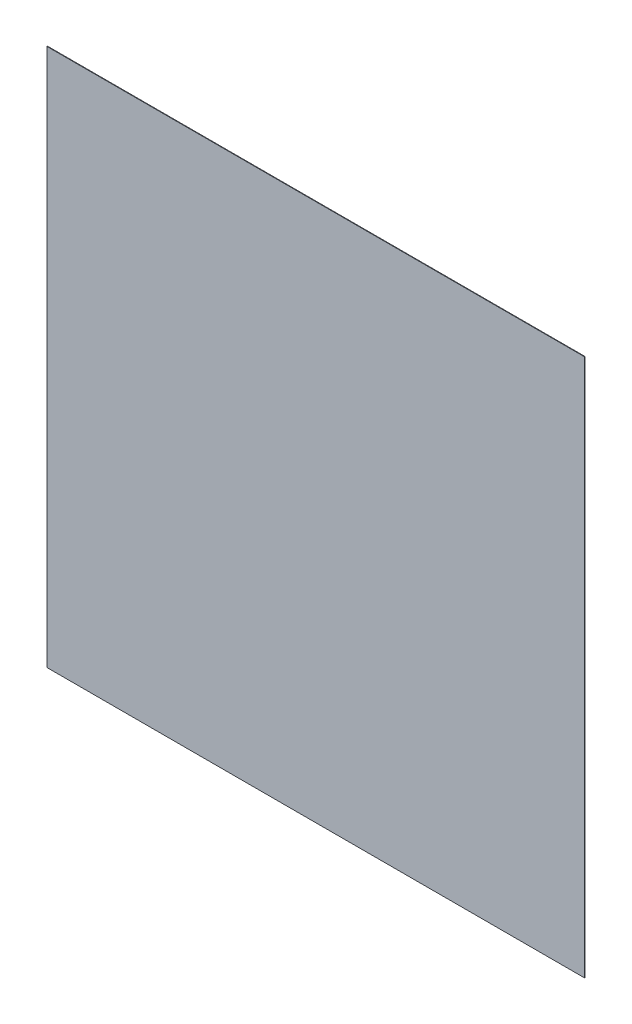
ISO-10303-21;
HEADER;
FILE_DESCRIPTION(('STEP AP214'),'2;1');
FILE_NAME('part.step','',(''),(''),'','','');
FILE_SCHEMA(('AUTOMOTIVE_DESIGN { 1 0 10303 214 1 1 1 1 }'));
ENDSEC;
DATA;
#1=APPLICATION_CONTEXT('core data for automotive mechanical design processes');
#2=APPLICATION_PROTOCOL_DEFINITION('international standard','automotive_design',2000,#1);
#3=PRODUCT_CONTEXT('',#1,'mechanical');
#4=PRODUCT('Part','Part','',(#3));
#5=PRODUCT_RELATED_PRODUCT_CATEGORY('part','',(#4));
#6=PRODUCT_DEFINITION_FORMATION('','',#4);
#7=PRODUCT_DEFINITION_CONTEXT('part definition',#1,'design');
#8=PRODUCT_DEFINITION('design','',#6,#7);
#9=PRODUCT_DEFINITION_SHAPE('','',#8);
#10=(LENGTH_UNIT() NAMED_UNIT(*) SI_UNIT(.MILLI.,.METRE.));
#11=(NAMED_UNIT(*) PLANE_ANGLE_UNIT() SI_UNIT($,.RADIAN.));
#12=(NAMED_UNIT(*) SI_UNIT($,.STERADIAN.) SOLID_ANGLE_UNIT());
#13=UNCERTAINTY_MEASURE_WITH_UNIT(LENGTH_MEASURE(1.E-05),#10,'distance_accuracy_value','');
#14=(GEOMETRIC_REPRESENTATION_CONTEXT(3) GLOBAL_UNCERTAINTY_ASSIGNED_CONTEXT((#13)) GLOBAL_UNIT_ASSIGNED_CONTEXT((#10,
#11,#12)) REPRESENTATION_CONTEXT('',''));
#15=CARTESIAN_POINT('',(0.,0.,0.));
#16=DIRECTION('',(0.,0.,1.));
#17=DIRECTION('',(1.,0.,0.));
#18=AXIS2_PLACEMENT_3D('',#15,#16,#17);
#19=CARTESIAN_POINT('',(-307.526886589295,151.392425827874,1.));
#20=DIRECTION('',(1.,0.,0.));
#21=DIRECTION('',(0.,1.,0.));
#22=AXIS2_PLACEMENT_3D('',#19,#20,#21);
#23=PLANE('',#22);
#24=DIRECTION('',(0.,-1.,0.));
#25=VECTOR('',#24,1.);
#26=CARTESIAN_POINT('',(-307.526886589295,151.392425827874,0.));
#27=LINE('',#26,#25);
#28=CARTESIAN_POINT('',(-307.526886589295,151.392425827874,0.));
#29=VERTEX_POINT('',#28);
#30=CARTESIAN_POINT('',(-307.526886589295,-848.607574172126,0.));
#31=VERTEX_POINT('',#30);
#32=EDGE_CURVE('E99',#29,#31,#27,.T.);
#33=ORIENTED_EDGE('',*,*,#32,.T.);
#34=DIRECTION('',(0.,0.,-1.));
#35=VECTOR('',#34,1.);
#36=CARTESIAN_POINT('',(-307.526886589295,-848.607574172126,1.));
#37=LINE('',#36,#35);
#38=CARTESIAN_POINT('',(-307.526886589295,-848.607574172126,1.));
#39=VERTEX_POINT('',#38);
#40=EDGE_CURVE('E11',#39,#31,#37,.T.);
#41=ORIENTED_EDGE('',*,*,#40,.F.);
#42=DIRECTION('',(0.,-1.,0.));
#43=VECTOR('',#42,1.);
#44=CARTESIAN_POINT('',(-307.526886589295,151.392425827874,1.));
#45=LINE('',#44,#43);
#46=CARTESIAN_POINT('',(-307.526886589295,151.392425827874,1.));
#47=VERTEX_POINT('',#46);
#48=EDGE_CURVE('E87',#47,#39,#45,.T.);
#49=ORIENTED_EDGE('',*,*,#48,.F.);
#50=DIRECTION('',(0.,0.,-1.));
#51=VECTOR('',#50,1.);
#52=CARTESIAN_POINT('',(-307.526886589295,151.392425827874,1.));
#53=LINE('',#52,#51);
#54=EDGE_CURVE('E95',#47,#29,#53,.T.);
#55=ORIENTED_EDGE('',*,*,#54,.T.);
#56=EDGE_LOOP('',(#33,#41,#49,#55));
#57=FACE_BOUND('',#56,.T.);
#58=ADVANCED_FACE('F36',(#57),#23,.F.);
#59=CARTESIAN_POINT('',(-307.526886589295,-848.607574172126,1.));
#60=DIRECTION('',(0.,1.,0.));
#61=DIRECTION('',(0.,0.,1.));
#62=AXIS2_PLACEMENT_3D('',#59,#60,#61);
#63=PLANE('',#62);
#64=DIRECTION('',(1.,0.,0.));
#65=VECTOR('',#64,1.);
#66=CARTESIAN_POINT('',(-307.526886589295,-848.607574172126,0.));
#67=LINE('',#66,#65);
#68=CARTESIAN_POINT('',(692.473113410706,-848.607574172126,0.));
#69=VERTEX_POINT('',#68);
#70=EDGE_CURVE('E91',#31,#69,#67,.T.);
#71=ORIENTED_EDGE('',*,*,#70,.T.);
#72=DIRECTION('',(0.,0.,-1.));
#73=VECTOR('',#72,1.);
#74=CARTESIAN_POINT('',(692.473113410706,-848.607574172126,1.));
#75=LINE('',#74,#73);
#76=CARTESIAN_POINT('',(692.473113410706,-848.607574172126,1.));
#77=VERTEX_POINT('',#76);
#78=EDGE_CURVE('E44',#77,#69,#75,.T.);
#79=ORIENTED_EDGE('',*,*,#78,.F.);
#80=DIRECTION('',(1.,0.,0.));
#81=VECTOR('',#80,1.);
#82=CARTESIAN_POINT('',(-307.526886589295,-848.607574172126,1.));
#83=LINE('',#82,#81);
#84=EDGE_CURVE('E82',#39,#77,#83,.T.);
#85=ORIENTED_EDGE('',*,*,#84,.F.);
#86=ORIENTED_EDGE('',*,*,#40,.T.);
#87=EDGE_LOOP('',(#71,#79,#85,#86));
#88=FACE_BOUND('',#87,.T.);
#89=ADVANCED_FACE('F90',(#88),#63,.F.);
#90=CARTESIAN_POINT('',(692.473113410705,151.392425827874,1.));
#91=DIRECTION('',(-1.,0.,0.));
#92=DIRECTION('',(0.,-1.,0.));
#93=AXIS2_PLACEMENT_3D('',#90,#91,#92);
#94=PLANE('',#93);
#95=DIRECTION('',(0.,1.,0.));
#96=VECTOR('',#95,1.);
#97=CARTESIAN_POINT('',(692.473113410705,151.392425827874,0.));
#98=LINE('',#97,#96);
#99=CARTESIAN_POINT('',(692.473113410705,151.392425827874,0.));
#100=VERTEX_POINT('',#99);
#101=EDGE_CURVE('E69',#69,#100,#98,.T.);
#102=ORIENTED_EDGE('',*,*,#101,.T.);
#103=DIRECTION('',(0.,0.,-1.));
#104=VECTOR('',#103,1.);
#105=CARTESIAN_POINT('',(692.473113410705,151.392425827874,1.));
#106=LINE('',#105,#104);
#107=CARTESIAN_POINT('',(692.473113410705,151.392425827874,1.));
#108=VERTEX_POINT('',#107);
#109=EDGE_CURVE('E92',#108,#100,#106,.T.);
#110=ORIENTED_EDGE('',*,*,#109,.F.);
#111=DIRECTION('',(0.,1.,0.));
#112=VECTOR('',#111,1.);
#113=CARTESIAN_POINT('',(692.473113410705,151.392425827874,1.));
#114=LINE('',#113,#112);
#115=EDGE_CURVE('E85',#77,#108,#114,.T.);
#116=ORIENTED_EDGE('',*,*,#115,.F.);
#117=ORIENTED_EDGE('',*,*,#78,.T.);
#118=EDGE_LOOP('',(#102,#110,#116,#117));
#119=FACE_BOUND('',#118,.T.);
#120=ADVANCED_FACE('F93',(#119),#94,.F.);
#121=CARTESIAN_POINT('',(-307.526886589295,151.392425827874,1.));
#122=DIRECTION('',(0.,-1.,0.));
#123=DIRECTION('',(0.,0.,-1.));
#124=AXIS2_PLACEMENT_3D('',#121,#122,#123);
#125=PLANE('',#124);
#126=DIRECTION('',(-1.,0.,0.));
#127=VECTOR('',#126,1.);
#128=CARTESIAN_POINT('',(-307.526886589295,151.392425827874,0.));
#129=LINE('',#128,#127);
#130=EDGE_CURVE('E75',#100,#29,#129,.T.);
#131=ORIENTED_EDGE('',*,*,#130,.T.);
#132=ORIENTED_EDGE('',*,*,#54,.F.);
#133=DIRECTION('',(-1.,0.,0.));
#134=VECTOR('',#133,1.);
#135=CARTESIAN_POINT('',(-307.526886589295,151.392425827874,1.));
#136=LINE('',#135,#134);
#137=EDGE_CURVE('E52',#108,#47,#136,.T.);
#138=ORIENTED_EDGE('',*,*,#137,.F.);
#139=ORIENTED_EDGE('',*,*,#109,.T.);
#140=EDGE_LOOP('',(#131,#132,#138,#139));
#141=FACE_BOUND('',#140,.T.);
#142=ADVANCED_FACE('F106',(#141),#125,.F.);
#143=CARTESIAN_POINT('',(0.,0.,1.));
#144=DIRECTION('',(0.,0.,1.));
#145=DIRECTION('',(1.,0.,0.));
#146=AXIS2_PLACEMENT_3D('',#143,#144,#145);
#147=PLANE('',#146);
#148=ORIENTED_EDGE('',*,*,#48,.T.);
#149=ORIENTED_EDGE('',*,*,#84,.T.);
#150=ORIENTED_EDGE('',*,*,#115,.T.);
#151=ORIENTED_EDGE('',*,*,#137,.T.);
#152=EDGE_LOOP('',(#148,#149,#150,#151));
#153=FACE_BOUND('',#152,.T.);
#154=ADVANCED_FACE('F83',(#153),#147,.T.);
#155=CARTESIAN_POINT('',(0.,0.,0.));
#156=DIRECTION('',(0.,0.,1.));
#157=DIRECTION('',(1.,0.,0.));
#158=AXIS2_PLACEMENT_3D('',#155,#156,#157);
#159=PLANE('',#158);
#160=ORIENTED_EDGE('',*,*,#32,.F.);
#161=ORIENTED_EDGE('',*,*,#130,.F.);
#162=ORIENTED_EDGE('',*,*,#101,.F.);
#163=ORIENTED_EDGE('',*,*,#70,.F.);
#164=EDGE_LOOP('',(#160,#161,#162,#163));
#165=FACE_BOUND('',#164,.T.);
#166=ADVANCED_FACE('F109',(#165),#159,.F.);
#167=CLOSED_SHELL('',(#58,#89,#120,#142,#154,#166));
#168=MANIFOLD_SOLID_BREP('B2',#167);
#169=ADVANCED_BREP_SHAPE_REPRESENTATION('',(#18,#168),#14);
#170=SHAPE_DEFINITION_REPRESENTATION(#9,#169);
ENDSEC;
END-ISO-10303-21;
